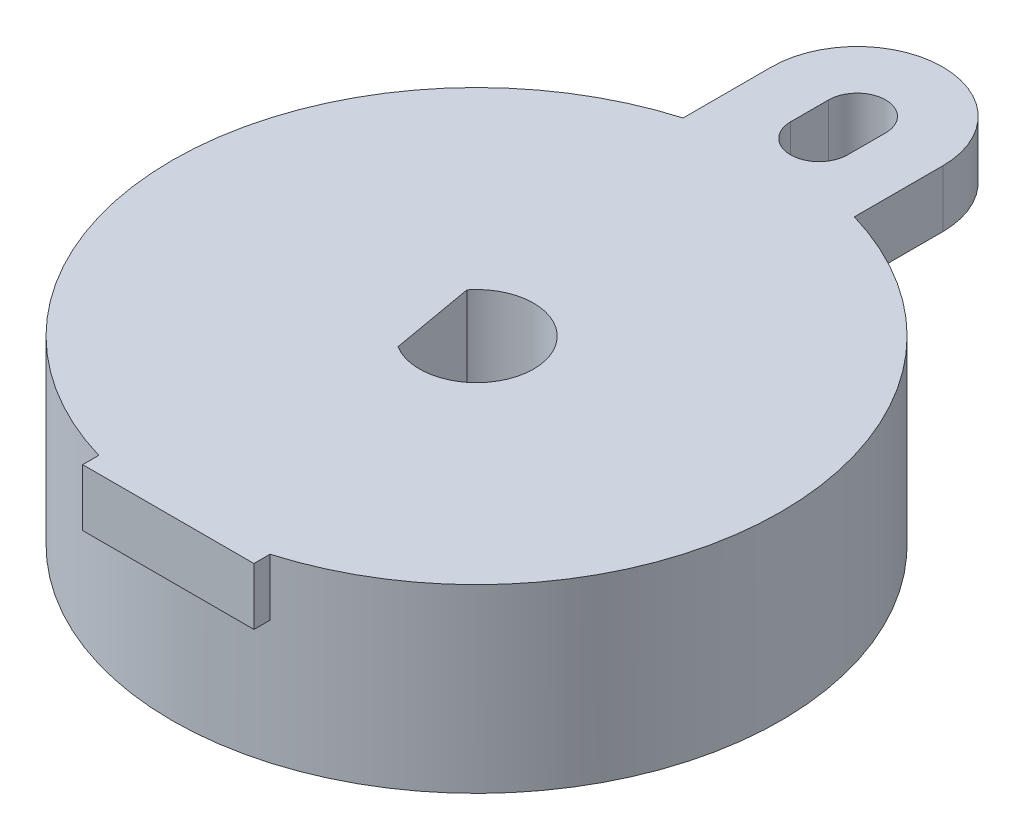
ISO-10303-21;
HEADER;
FILE_DESCRIPTION(('STEP AP214'),'2;1');
FILE_NAME('part.step','',(''),(''),'','','');
FILE_SCHEMA(('AUTOMOTIVE_DESIGN { 1 0 10303 214 1 1 1 1 }'));
ENDSEC;
DATA;
#1=APPLICATION_CONTEXT('core data for automotive mechanical design processes');
#2=APPLICATION_PROTOCOL_DEFINITION('international standard','automotive_design',2000,#1);
#3=PRODUCT_CONTEXT('',#1,'mechanical');
#4=PRODUCT('Part','Part','',(#3));
#5=PRODUCT_RELATED_PRODUCT_CATEGORY('part','',(#4));
#6=PRODUCT_DEFINITION_FORMATION('','',#4);
#7=PRODUCT_DEFINITION_CONTEXT('part definition',#1,'design');
#8=PRODUCT_DEFINITION('design','',#6,#7);
#9=PRODUCT_DEFINITION_SHAPE('','',#8);
#10=(LENGTH_UNIT() NAMED_UNIT(*) SI_UNIT(.MILLI.,.METRE.));
#11=(NAMED_UNIT(*) PLANE_ANGLE_UNIT() SI_UNIT($,.RADIAN.));
#12=(NAMED_UNIT(*) SI_UNIT($,.STERADIAN.) SOLID_ANGLE_UNIT());
#13=UNCERTAINTY_MEASURE_WITH_UNIT(LENGTH_MEASURE(1.E-05),#10,'distance_accuracy_value','');
#14=(GEOMETRIC_REPRESENTATION_CONTEXT(3) GLOBAL_UNCERTAINTY_ASSIGNED_CONTEXT((#13)) GLOBAL_UNIT_ASSIGNED_CONTEXT((#10,
#11,#12)) REPRESENTATION_CONTEXT('',''));
#15=CARTESIAN_POINT('',(0.,0.,0.));
#16=DIRECTION('',(0.,0.,1.));
#17=DIRECTION('',(1.,0.,0.));
#18=AXIS2_PLACEMENT_3D('',#15,#16,#17);
#19=CARTESIAN_POINT('',(-4.5,9.5,20.));
#20=DIRECTION('',(-1.,0.,0.));
#21=DIRECTION('',(0.,0.,1.));
#22=AXIS2_PLACEMENT_3D('',#19,#20,#21);
#23=PLANE('',#22);
#24=DIRECTION('',(0.,1.,0.));
#25=VECTOR('',#24,1.);
#26=CARTESIAN_POINT('',(-4.50000000000001,9.5,15.3541525327841));
#27=LINE('',#26,#25);
#28=CARTESIAN_POINT('',(-4.50000000000001,6.5,15.3541525327841));
#29=VERTEX_POINT('',#28);
#30=CARTESIAN_POINT('',(-4.50000000000001,9.5,15.3541525327841));
#31=VERTEX_POINT('',#30);
#32=EDGE_CURVE('E138',#29,#31,#27,.T.);
#33=ORIENTED_EDGE('',*,*,#32,.F.);
#34=DIRECTION('',(0.,0.,1.));
#35=VECTOR('',#34,1.);
#36=CARTESIAN_POINT('',(-4.5,6.5,0.));
#37=LINE('',#36,#35);
#38=CARTESIAN_POINT('',(-4.5,6.5,16.2));
#39=VERTEX_POINT('',#38);
#40=EDGE_CURVE('E154',#29,#39,#37,.T.);
#41=ORIENTED_EDGE('',*,*,#40,.T.);
#42=DIRECTION('',(0.,1.,0.));
#43=VECTOR('',#42,1.);
#44=CARTESIAN_POINT('',(-4.50000000000001,-75.7369297077063,16.2));
#45=LINE('',#44,#43);
#46=CARTESIAN_POINT('',(-4.50000000000001,9.5,16.2));
#47=VERTEX_POINT('',#46);
#48=EDGE_CURVE('E195',#39,#47,#45,.T.);
#49=ORIENTED_EDGE('',*,*,#48,.T.);
#50=DIRECTION('',(0.,0.,1.));
#51=VECTOR('',#50,1.);
#52=CARTESIAN_POINT('',(-4.5,9.5,20.));
#53=LINE('',#52,#51);
#54=EDGE_CURVE('E166',#47,#31,#53,.F.);
#55=ORIENTED_EDGE('',*,*,#54,.T.);
#56=EDGE_LOOP('',(#33,#41,#49,#55));
#57=FACE_BOUND('',#56,.T.);
#58=ADVANCED_FACE('F15',(#57),#23,.T.);
#59=CARTESIAN_POINT('',(4.5,9.5,20.));
#60=DIRECTION('',(1.,0.,0.));
#61=DIRECTION('',(0.,0.,-1.));
#62=AXIS2_PLACEMENT_3D('',#59,#60,#61);
#63=PLANE('',#62);
#64=DIRECTION('',(0.,1.,0.));
#65=VECTOR('',#64,1.);
#66=CARTESIAN_POINT('',(4.5,9.5,15.3541525327841));
#67=LINE('',#66,#65);
#68=CARTESIAN_POINT('',(4.5,9.5,15.3541525327841));
#69=VERTEX_POINT('',#68);
#70=CARTESIAN_POINT('',(4.50000000000001,6.5,15.3541525327841));
#71=VERTEX_POINT('',#70);
#72=EDGE_CURVE('E238',#69,#71,#67,.F.);
#73=ORIENTED_EDGE('',*,*,#72,.F.);
#74=DIRECTION('',(0.,0.,-1.));
#75=VECTOR('',#74,1.);
#76=CARTESIAN_POINT('',(4.5,9.5,20.));
#77=LINE('',#76,#75);
#78=CARTESIAN_POINT('',(4.5,9.5,16.2));
#79=VERTEX_POINT('',#78);
#80=EDGE_CURVE('E160',#69,#79,#77,.F.);
#81=ORIENTED_EDGE('',*,*,#80,.T.);
#82=DIRECTION('',(0.,1.,0.));
#83=VECTOR('',#82,1.);
#84=CARTESIAN_POINT('',(4.5,-75.7369297077063,16.2));
#85=LINE('',#84,#83);
#86=CARTESIAN_POINT('',(4.50000000000001,6.5,16.2));
#87=VERTEX_POINT('',#86);
#88=EDGE_CURVE('E189',#79,#87,#85,.F.);
#89=ORIENTED_EDGE('',*,*,#88,.T.);
#90=DIRECTION('',(0.,0.,1.));
#91=VECTOR('',#90,1.);
#92=CARTESIAN_POINT('',(4.50000000000001,6.5,0.));
#93=LINE('',#92,#91);
#94=EDGE_CURVE('E150',#87,#71,#93,.F.);
#95=ORIENTED_EDGE('',*,*,#94,.T.);
#96=EDGE_LOOP('',(#73,#81,#89,#95));
#97=FACE_BOUND('',#96,.T.);
#98=ADVANCED_FACE('F354',(#97),#63,.T.);
#99=CARTESIAN_POINT('',(0.,6.5,0.));
#100=DIRECTION('',(0.,1.,0.));
#101=DIRECTION('',(0.,0.,1.));
#102=AXIS2_PLACEMENT_3D('',#99,#100,#101);
#103=PLANE('',#102);
#104=DIRECTION('',(-1.,0.,0.));
#105=VECTOR('',#104,1.);
#106=CARTESIAN_POINT('',(12.8325225410958,6.50000000000001,16.2));
#107=LINE('',#106,#105);
#108=EDGE_CURVE('E185',#87,#39,#107,.T.);
#109=ORIENTED_EDGE('',*,*,#108,.T.);
#110=ORIENTED_EDGE('',*,*,#40,.F.);
#111=CARTESIAN_POINT('',(0.,6.5,0.));
#112=DIRECTION('',(0.,1.,0.));
#113=DIRECTION('',(0.,0.,1.));
#114=AXIS2_PLACEMENT_3D('',#111,#112,#113);
#115=CIRCLE('',#114,16.);
#116=EDGE_CURVE('E201',#71,#29,#115,.F.);
#117=ORIENTED_EDGE('',*,*,#116,.F.);
#118=ORIENTED_EDGE('',*,*,#94,.F.);
#119=EDGE_LOOP('',(#109,#110,#117,#118));
#120=FACE_BOUND('',#119,.T.);
#121=ADVANCED_FACE('F259',(#120),#103,.F.);
#122=CARTESIAN_POINT('',(0.,6.5,0.));
#123=DIRECTION('',(0.,-1.,0.));
#124=DIRECTION('',(0.,0.,-1.));
#125=AXIS2_PLACEMENT_3D('',#122,#123,#124);
#126=PLANE('',#125);
#127=CARTESIAN_POINT('',(0.,6.5,-18.));
#128=DIRECTION('',(0.,1.,0.));
#129=DIRECTION('',(0.,0.,1.));
#130=AXIS2_PLACEMENT_3D('',#127,#128,#129);
#131=CIRCLE('',#130,1.5);
#132=CARTESIAN_POINT('',(-1.5,6.5,-18.));
#133=VERTEX_POINT('',#132);
#134=CARTESIAN_POINT('',(1.5,6.5,-18.));
#135=VERTEX_POINT('',#134);
#136=EDGE_CURVE('E116',#133,#135,#131,.T.);
#137=ORIENTED_EDGE('',*,*,#136,.T.);
#138=DIRECTION('',(0.,0.,-1.));
#139=VECTOR('',#138,1.);
#140=CARTESIAN_POINT('',(1.5,6.5,-18.));
#141=LINE('',#140,#139);
#142=CARTESIAN_POINT('',(1.5,6.5,-20.));
#143=VERTEX_POINT('',#142);
#144=EDGE_CURVE('E145',#135,#143,#141,.T.);
#145=ORIENTED_EDGE('',*,*,#144,.T.);
#146=CARTESIAN_POINT('',(0.,6.5,-20.));
#147=DIRECTION('',(0.,1.,0.));
#148=DIRECTION('',(0.,0.,1.));
#149=AXIS2_PLACEMENT_3D('',#146,#147,#148);
#150=CIRCLE('',#149,1.5);
#151=CARTESIAN_POINT('',(-1.5,6.5,-20.));
#152=VERTEX_POINT('',#151);
#153=EDGE_CURVE('E233',#143,#152,#150,.T.);
#154=ORIENTED_EDGE('',*,*,#153,.T.);
#155=DIRECTION('',(0.,0.,1.));
#156=VECTOR('',#155,1.);
#157=CARTESIAN_POINT('',(-1.5,6.5,-18.));
#158=LINE('',#157,#156);
#159=EDGE_CURVE('E140',#152,#133,#158,.T.);
#160=ORIENTED_EDGE('',*,*,#159,.T.);
#161=EDGE_LOOP('',(#137,#145,#154,#160));
#162=FACE_BOUND('',#161,.T.);
#163=DIRECTION('',(0.,0.,1.));
#164=VECTOR('',#163,1.);
#165=CARTESIAN_POINT('',(-4.5,6.5,-20.));
#166=LINE('',#165,#164);
#167=CARTESIAN_POINT('',(-4.5,6.5,-20.));
#168=VERTEX_POINT('',#167);
#169=CARTESIAN_POINT('',(-4.50000000000001,6.5,-15.3541525327841));
#170=VERTEX_POINT('',#169);
#171=EDGE_CURVE('E175',#168,#170,#166,.T.);
#172=ORIENTED_EDGE('',*,*,#171,.F.);
#173=CARTESIAN_POINT('',(0.,6.5,-20.));
#174=DIRECTION('',(0.,1.,0.));
#175=DIRECTION('',(0.,0.,1.));
#176=AXIS2_PLACEMENT_3D('',#173,#174,#175);
#177=CIRCLE('',#176,4.5);
#178=CARTESIAN_POINT('',(4.5,6.5,-20.));
#179=VERTEX_POINT('',#178);
#180=EDGE_CURVE('E18',#179,#168,#177,.T.);
#181=ORIENTED_EDGE('',*,*,#180,.F.);
#182=DIRECTION('',(0.,0.,-1.));
#183=VECTOR('',#182,1.);
#184=CARTESIAN_POINT('',(4.5,6.5,-20.));
#185=LINE('',#184,#183);
#186=CARTESIAN_POINT('',(4.49999999999999,6.5,-15.3541525327841));
#187=VERTEX_POINT('',#186);
#188=EDGE_CURVE('E169',#187,#179,#185,.T.);
#189=ORIENTED_EDGE('',*,*,#188,.F.);
#190=CARTESIAN_POINT('',(0.,6.5,0.));
#191=DIRECTION('',(0.,1.,0.));
#192=DIRECTION('',(0.,0.,1.));
#193=AXIS2_PLACEMENT_3D('',#190,#191,#192);
#194=CIRCLE('',#193,16.);
#195=EDGE_CURVE('E239',#170,#187,#194,.F.);
#196=ORIENTED_EDGE('',*,*,#195,.F.);
#197=EDGE_LOOP('',(#172,#181,#189,#196));
#198=FACE_BOUND('',#197,.T.);
#199=ADVANCED_FACE('F249',(#162,#198),#126,.T.);
#200=CARTESIAN_POINT('',(0.,0.,20.));
#201=DIRECTION('',(0.,-1.,0.));
#202=DIRECTION('',(0.,0.,-1.));
#203=AXIS2_PLACEMENT_3D('',#200,#201,#202);
#204=PLANE('',#203);
#205=CARTESIAN_POINT('',(0.,0.,0.));
#206=DIRECTION('',(0.,1.,0.));
#207=DIRECTION('',(0.,0.,1.));
#208=AXIS2_PLACEMENT_3D('',#205,#206,#207);
#209=CIRCLE('',#208,3.);
#210=CARTESIAN_POINT('',(-1.5813263765922,0.,2.54939343583798));
#211=VERTEX_POINT('',#210);
#212=CARTESIAN_POINT('',(-2.35790463545664,0.,-1.85480072517026));
#213=VERTEX_POINT('',#212);
#214=EDGE_CURVE('E107',#211,#213,#209,.T.);
#215=ORIENTED_EDGE('',*,*,#214,.T.);
#216=DIRECTION('',(0.173648177666931,0.,0.984807753012208));
#217=VECTOR('',#216,1.);
#218=CARTESIAN_POINT('',(-1.5813263765922,0.,2.54939343583798));
#219=LINE('',#218,#217);
#220=EDGE_CURVE('E120',#213,#211,#219,.T.);
#221=ORIENTED_EDGE('',*,*,#220,.T.);
#222=EDGE_LOOP('',(#215,#221));
#223=FACE_BOUND('',#222,.T.);
#224=CARTESIAN_POINT('',(0.,0.,0.));
#225=DIRECTION('',(0.,1.,0.));
#226=DIRECTION('',(0.,0.,1.));
#227=AXIS2_PLACEMENT_3D('',#224,#225,#226);
#228=CIRCLE('',#227,16.);
#229=CARTESIAN_POINT('',(0.,0.,16.));
#230=VERTEX_POINT('',#229);
#231=EDGE_CURVE('E173',#230,#230,#228,.T.);
#232=ORIENTED_EDGE('',*,*,#231,.F.);
#233=EDGE_LOOP('',(#232));
#234=FACE_BOUND('',#233,.T.);
#235=ADVANCED_FACE('F123',(#223,#234),#204,.T.);
#236=CARTESIAN_POINT('',(-4.5,9.5,-20.));
#237=DIRECTION('',(-1.,0.,0.));
#238=DIRECTION('',(0.,0.,1.));
#239=AXIS2_PLACEMENT_3D('',#236,#237,#238);
#240=PLANE('',#239);
#241=DIRECTION('',(0.,1.,0.));
#242=VECTOR('',#241,1.);
#243=CARTESIAN_POINT('',(-4.49999999999999,9.5,-20.));
#244=LINE('',#243,#242);
#245=CARTESIAN_POINT('',(-4.49999999999999,9.5,-20.));
#246=VERTEX_POINT('',#245);
#247=EDGE_CURVE('E179',#168,#246,#244,.T.);
#248=ORIENTED_EDGE('',*,*,#247,.F.);
#249=ORIENTED_EDGE('',*,*,#171,.T.);
#250=DIRECTION('',(0.,1.,0.));
#251=VECTOR('',#250,1.);
#252=CARTESIAN_POINT('',(-4.50000000000001,9.5,-15.3541525327841));
#253=LINE('',#252,#251);
#254=CARTESIAN_POINT('',(-4.5,9.5,-15.3541525327841));
#255=VERTEX_POINT('',#254);
#256=EDGE_CURVE('E180',#170,#255,#253,.T.);
#257=ORIENTED_EDGE('',*,*,#256,.T.);
#258=DIRECTION('',(0.,0.,-1.));
#259=VECTOR('',#258,1.);
#260=CARTESIAN_POINT('',(-4.5,9.5,20.));
#261=LINE('',#260,#259);
#262=EDGE_CURVE('E132',#255,#246,#261,.T.);
#263=ORIENTED_EDGE('',*,*,#262,.T.);
#264=EDGE_LOOP('',(#248,#249,#257,#263));
#265=FACE_BOUND('',#264,.T.);
#266=ADVANCED_FACE('F248',(#265),#240,.T.);
#267=CARTESIAN_POINT('',(0.,9.5,-20.));
#268=DIRECTION('',(0.,1.,0.));
#269=DIRECTION('',(0.,0.,1.));
#270=AXIS2_PLACEMENT_3D('',#267,#268,#269);
#271=CYLINDRICAL_SURFACE('',#270,4.5);
#272=DIRECTION('',(0.,1.,0.));
#273=VECTOR('',#272,1.);
#274=CARTESIAN_POINT('',(4.5,9.5,-20.));
#275=LINE('',#274,#273);
#276=CARTESIAN_POINT('',(4.5,9.5,-20.));
#277=VERTEX_POINT('',#276);
#278=EDGE_CURVE('E174',#179,#277,#275,.T.);
#279=ORIENTED_EDGE('',*,*,#278,.F.);
#280=ORIENTED_EDGE('',*,*,#180,.T.);
#281=ORIENTED_EDGE('',*,*,#247,.T.);
#282=CARTESIAN_POINT('',(0.,9.5,-20.));
#283=DIRECTION('',(0.,1.,0.));
#284=DIRECTION('',(0.,0.,1.));
#285=AXIS2_PLACEMENT_3D('',#282,#283,#284);
#286=CIRCLE('',#285,4.5);
#287=EDGE_CURVE('E227',#246,#277,#286,.F.);
#288=ORIENTED_EDGE('',*,*,#287,.T.);
#289=EDGE_LOOP('',(#279,#280,#281,#288));
#290=FACE_BOUND('',#289,.T.);
#291=ADVANCED_FACE('F256',(#290),#271,.T.);
#292=CARTESIAN_POINT('',(4.5,9.5,-20.));
#293=DIRECTION('',(1.,0.,0.));
#294=DIRECTION('',(0.,0.,-1.));
#295=AXIS2_PLACEMENT_3D('',#292,#293,#294);
#296=PLANE('',#295);
#297=DIRECTION('',(0.,1.,0.));
#298=VECTOR('',#297,1.);
#299=CARTESIAN_POINT('',(4.49999999999999,9.5,-15.3541525327841));
#300=LINE('',#299,#298);
#301=CARTESIAN_POINT('',(4.5,9.5,-15.3541525327841));
#302=VERTEX_POINT('',#301);
#303=EDGE_CURVE('E241',#187,#302,#300,.T.);
#304=ORIENTED_EDGE('',*,*,#303,.F.);
#305=ORIENTED_EDGE('',*,*,#188,.T.);
#306=ORIENTED_EDGE('',*,*,#278,.T.);
#307=DIRECTION('',(0.,0.,-1.));
#308=VECTOR('',#307,1.);
#309=CARTESIAN_POINT('',(4.5,9.5,20.));
#310=LINE('',#309,#308);
#311=EDGE_CURVE('E226',#277,#302,#310,.F.);
#312=ORIENTED_EDGE('',*,*,#311,.T.);
#313=EDGE_LOOP('',(#304,#305,#306,#312));
#314=FACE_BOUND('',#313,.T.);
#315=ADVANCED_FACE('F295',(#314),#296,.T.);
#316=CARTESIAN_POINT('',(0.,9.5,0.));
#317=DIRECTION('',(0.,1.,0.));
#318=DIRECTION('',(0.,0.,1.));
#319=AXIS2_PLACEMENT_3D('',#316,#317,#318);
#320=CYLINDRICAL_SURFACE('',#319,16.);
#321=ORIENTED_EDGE('',*,*,#256,.F.);
#322=ORIENTED_EDGE('',*,*,#195,.T.);
#323=ORIENTED_EDGE('',*,*,#303,.T.);
#324=CARTESIAN_POINT('',(0.,9.5,0.));
#325=DIRECTION('',(0.,1.,0.));
#326=DIRECTION('',(0.,0.,1.));
#327=AXIS2_PLACEMENT_3D('',#324,#325,#326);
#328=CIRCLE('',#327,16.);
#329=EDGE_CURVE('E209',#302,#69,#328,.F.);
#330=ORIENTED_EDGE('',*,*,#329,.T.);
#331=ORIENTED_EDGE('',*,*,#72,.T.);
#332=ORIENTED_EDGE('',*,*,#116,.T.);
#333=ORIENTED_EDGE('',*,*,#32,.T.);
#334=CARTESIAN_POINT('',(0.,9.5,0.));
#335=DIRECTION('',(0.,1.,0.));
#336=DIRECTION('',(0.,0.,1.));
#337=AXIS2_PLACEMENT_3D('',#334,#335,#336);
#338=CIRCLE('',#337,16.);
#339=EDGE_CURVE('E126',#31,#255,#338,.F.);
#340=ORIENTED_EDGE('',*,*,#339,.T.);
#341=EDGE_LOOP('',(#321,#322,#323,#330,#331,#332,#333,#340));
#342=FACE_BOUND('',#341,.T.);
#343=ORIENTED_EDGE('',*,*,#231,.T.);
#344=EDGE_LOOP('',(#343));
#345=FACE_BOUND('',#344,.T.);
#346=ADVANCED_FACE('F246',(#342,#345),#320,.T.);
#347=CARTESIAN_POINT('',(12.8325225410958,-75.7369297077063,16.2));
#348=DIRECTION('',(0.,0.,-1.));
#349=DIRECTION('',(-1.,0.,0.));
#350=AXIS2_PLACEMENT_3D('',#347,#348,#349);
#351=PLANE('',#350);
#352=ORIENTED_EDGE('',*,*,#88,.F.);
#353=DIRECTION('',(1.,0.,0.));
#354=VECTOR('',#353,1.);
#355=CARTESIAN_POINT('',(0.,9.5,16.2));
#356=LINE('',#355,#354);
#357=EDGE_CURVE('E204',#79,#47,#356,.F.);
#358=ORIENTED_EDGE('',*,*,#357,.T.);
#359=ORIENTED_EDGE('',*,*,#48,.F.);
#360=ORIENTED_EDGE('',*,*,#108,.F.);
#361=EDGE_LOOP('',(#352,#358,#359,#360));
#362=FACE_BOUND('',#361,.T.);
#363=ADVANCED_FACE('F288',(#362),#351,.F.);
#364=CARTESIAN_POINT('',(1.5,59.289543766165,-18.));
#365=DIRECTION('',(1.,0.,0.));
#366=DIRECTION('',(0.,0.,-1.));
#367=AXIS2_PLACEMENT_3D('',#364,#365,#366);
#368=PLANE('',#367);
#369=DIRECTION('',(0.,1.,0.));
#370=VECTOR('',#369,1.);
#371=CARTESIAN_POINT('',(1.5,59.289543766165,-18.));
#372=LINE('',#371,#370);
#373=CARTESIAN_POINT('',(1.5,9.5,-18.));
#374=VERTEX_POINT('',#373);
#375=EDGE_CURVE('E149',#374,#135,#372,.F.);
#376=ORIENTED_EDGE('',*,*,#375,.F.);
#377=DIRECTION('',(0.,0.,-1.));
#378=VECTOR('',#377,1.);
#379=CARTESIAN_POINT('',(1.5,9.5,20.));
#380=LINE('',#379,#378);
#381=CARTESIAN_POINT('',(1.5,9.5,-20.));
#382=VERTEX_POINT('',#381);
#383=EDGE_CURVE('E219',#374,#382,#380,.T.);
#384=ORIENTED_EDGE('',*,*,#383,.T.);
#385=DIRECTION('',(0.,1.,0.));
#386=VECTOR('',#385,1.);
#387=CARTESIAN_POINT('',(1.5,59.289543766165,-20.));
#388=LINE('',#387,#386);
#389=EDGE_CURVE('E148',#382,#143,#388,.F.);
#390=ORIENTED_EDGE('',*,*,#389,.T.);
#391=ORIENTED_EDGE('',*,*,#144,.F.);
#392=EDGE_LOOP('',(#376,#384,#390,#391));
#393=FACE_BOUND('',#392,.T.);
#394=ADVANCED_FACE('F284',(#393),#368,.F.);
#395=CARTESIAN_POINT('',(0.,59.289543766165,-20.));
#396=DIRECTION('',(0.,1.,0.));
#397=DIRECTION('',(0.,0.,1.));
#398=AXIS2_PLACEMENT_3D('',#395,#396,#397);
#399=CYLINDRICAL_SURFACE('',#398,1.5);
#400=ORIENTED_EDGE('',*,*,#389,.F.);
#401=CARTESIAN_POINT('',(0.,9.5,-20.));
#402=DIRECTION('',(0.,1.,0.));
#403=DIRECTION('',(0.,0.,1.));
#404=AXIS2_PLACEMENT_3D('',#401,#402,#403);
#405=CIRCLE('',#404,1.5);
#406=CARTESIAN_POINT('',(-1.5,9.5,-20.));
#407=VERTEX_POINT('',#406);
#408=EDGE_CURVE('E215',#382,#407,#405,.T.);
#409=ORIENTED_EDGE('',*,*,#408,.T.);
#410=DIRECTION('',(0.,1.,0.));
#411=VECTOR('',#410,1.);
#412=CARTESIAN_POINT('',(-1.5,59.289543766165,-20.));
#413=LINE('',#412,#411);
#414=EDGE_CURVE('E144',#407,#152,#413,.F.);
#415=ORIENTED_EDGE('',*,*,#414,.T.);
#416=ORIENTED_EDGE('',*,*,#153,.F.);
#417=EDGE_LOOP('',(#400,#409,#415,#416));
#418=FACE_BOUND('',#417,.T.);
#419=ADVANCED_FACE('F280',(#418),#399,.F.);
#420=CARTESIAN_POINT('',(-1.5,59.289543766165,-18.));
#421=DIRECTION('',(-1.,0.,0.));
#422=DIRECTION('',(0.,0.,1.));
#423=AXIS2_PLACEMENT_3D('',#420,#421,#422);
#424=PLANE('',#423);
#425=ORIENTED_EDGE('',*,*,#414,.F.);
#426=DIRECTION('',(0.,0.,-1.));
#427=VECTOR('',#426,1.);
#428=CARTESIAN_POINT('',(-1.5,9.5,20.));
#429=LINE('',#428,#427);
#430=CARTESIAN_POINT('',(-1.5,9.5,-18.));
#431=VERTEX_POINT('',#430);
#432=EDGE_CURVE('E214',#407,#431,#429,.F.);
#433=ORIENTED_EDGE('',*,*,#432,.T.);
#434=DIRECTION('',(0.,1.,0.));
#435=VECTOR('',#434,1.);
#436=CARTESIAN_POINT('',(-1.5,59.289543766165,-18.));
#437=LINE('',#436,#435);
#438=EDGE_CURVE('E143',#431,#133,#437,.F.);
#439=ORIENTED_EDGE('',*,*,#438,.T.);
#440=ORIENTED_EDGE('',*,*,#159,.F.);
#441=EDGE_LOOP('',(#425,#433,#439,#440));
#442=FACE_BOUND('',#441,.T.);
#443=ADVANCED_FACE('F276',(#442),#424,.F.);
#444=CARTESIAN_POINT('',(0.,59.289543766165,-18.));
#445=DIRECTION('',(0.,1.,0.));
#446=DIRECTION('',(0.,0.,1.));
#447=AXIS2_PLACEMENT_3D('',#444,#445,#446);
#448=CYLINDRICAL_SURFACE('',#447,1.5);
#449=ORIENTED_EDGE('',*,*,#136,.F.);
#450=ORIENTED_EDGE('',*,*,#438,.F.);
#451=CARTESIAN_POINT('',(0.,9.5,-18.));
#452=DIRECTION('',(0.,1.,0.));
#453=DIRECTION('',(0.,0.,1.));
#454=AXIS2_PLACEMENT_3D('',#451,#452,#453);
#455=CIRCLE('',#454,1.5);
#456=EDGE_CURVE('E208',#431,#374,#455,.T.);
#457=ORIENTED_EDGE('',*,*,#456,.T.);
#458=ORIENTED_EDGE('',*,*,#375,.T.);
#459=EDGE_LOOP('',(#449,#450,#457,#458));
#460=FACE_BOUND('',#459,.T.);
#461=ADVANCED_FACE('F273',(#460),#448,.F.);
#462=CARTESIAN_POINT('',(0.,59.289543766165,0.));
#463=DIRECTION('',(0.,1.,0.));
#464=DIRECTION('',(0.,0.,1.));
#465=AXIS2_PLACEMENT_3D('',#462,#463,#464);
#466=CYLINDRICAL_SURFACE('',#465,3.);
#467=ORIENTED_EDGE('',*,*,#214,.F.);
#468=DIRECTION('',(0.,1.,0.));
#469=VECTOR('',#468,1.);
#470=CARTESIAN_POINT('',(-1.5813263765922,59.289543766165,2.54939343583798));
#471=LINE('',#470,#469);
#472=CARTESIAN_POINT('',(-1.5813263765922,9.5,2.54939343583798));
#473=VERTEX_POINT('',#472);
#474=EDGE_CURVE('E110',#211,#473,#471,.T.);
#475=ORIENTED_EDGE('',*,*,#474,.T.);
#476=CARTESIAN_POINT('',(0.,9.5,0.));
#477=DIRECTION('',(0.,1.,0.));
#478=DIRECTION('',(0.,0.,1.));
#479=AXIS2_PLACEMENT_3D('',#476,#477,#478);
#480=CIRCLE('',#479,3.);
#481=CARTESIAN_POINT('',(-2.35790463545664,9.5,-1.85480072517026));
#482=VERTEX_POINT('',#481);
#483=EDGE_CURVE('E24',#473,#482,#480,.T.);
#484=ORIENTED_EDGE('',*,*,#483,.T.);
#485=DIRECTION('',(0.,1.,0.));
#486=VECTOR('',#485,1.);
#487=CARTESIAN_POINT('',(-2.35790463545664,59.289543766165,-1.85480072517026));
#488=LINE('',#487,#486);
#489=EDGE_CURVE('E111',#482,#213,#488,.F.);
#490=ORIENTED_EDGE('',*,*,#489,.T.);
#491=EDGE_LOOP('',(#467,#475,#484,#490));
#492=FACE_BOUND('',#491,.T.);
#493=ADVANCED_FACE('F109',(#492),#466,.F.);
#494=CARTESIAN_POINT('',(-1.5813263765922,59.289543766165,2.54939343583798));
#495=DIRECTION('',(-0.984807753012208,0.,0.173648177666931));
#496=DIRECTION('',(0.173648177666931,0.,0.984807753012208));
#497=AXIS2_PLACEMENT_3D('',#494,#495,#496);
#498=PLANE('',#497);
#499=ORIENTED_EDGE('',*,*,#489,.F.);
#500=DIRECTION('',(0.173648177666931,0.,0.984807753012208));
#501=VECTOR('',#500,1.);
#502=CARTESIAN_POINT('',(-2.35790463545664,9.5,-1.85480072517026));
#503=LINE('',#502,#501);
#504=EDGE_CURVE('E10',#482,#473,#503,.T.);
#505=ORIENTED_EDGE('',*,*,#504,.T.);
#506=ORIENTED_EDGE('',*,*,#474,.F.);
#507=ORIENTED_EDGE('',*,*,#220,.F.);
#508=EDGE_LOOP('',(#499,#505,#506,#507));
#509=FACE_BOUND('',#508,.T.);
#510=ADVANCED_FACE('F119',(#509),#498,.F.);
#511=CARTESIAN_POINT('',(0.,9.5,20.));
#512=DIRECTION('',(0.,-1.,0.));
#513=DIRECTION('',(0.,0.,-1.));
#514=AXIS2_PLACEMENT_3D('',#511,#512,#513);
#515=PLANE('',#514);
#516=ORIENTED_EDGE('',*,*,#504,.F.);
#517=ORIENTED_EDGE('',*,*,#483,.F.);
#518=EDGE_LOOP('',(#516,#517));
#519=FACE_BOUND('',#518,.T.);
#520=ORIENTED_EDGE('',*,*,#432,.F.);
#521=ORIENTED_EDGE('',*,*,#408,.F.);
#522=ORIENTED_EDGE('',*,*,#383,.F.);
#523=ORIENTED_EDGE('',*,*,#456,.F.);
#524=EDGE_LOOP('',(#520,#521,#522,#523));
#525=FACE_BOUND('',#524,.T.);
#526=ORIENTED_EDGE('',*,*,#357,.F.);
#527=ORIENTED_EDGE('',*,*,#80,.F.);
#528=ORIENTED_EDGE('',*,*,#329,.F.);
#529=ORIENTED_EDGE('',*,*,#311,.F.);
#530=ORIENTED_EDGE('',*,*,#287,.F.);
#531=ORIENTED_EDGE('',*,*,#262,.F.);
#532=ORIENTED_EDGE('',*,*,#339,.F.);
#533=ORIENTED_EDGE('',*,*,#54,.F.);
#534=EDGE_LOOP('',(#526,#527,#528,#529,#530,#531,#532,#533));
#535=FACE_BOUND('',#534,.T.);
#536=ADVANCED_FACE('F262',(#519,#525,#535),#515,.F.);
#537=CLOSED_SHELL('',(#58,#98,#121,#199,#235,#266,#291,#315,#346,#363,#394,#419,#443,#461,#493,
#510,#536));
#538=MANIFOLD_SOLID_BREP('B1',#537);
#539=ADVANCED_BREP_SHAPE_REPRESENTATION('',(#18,#538),#14);
#540=SHAPE_DEFINITION_REPRESENTATION(#9,#539);
ENDSEC;
END-ISO-10303-21;
